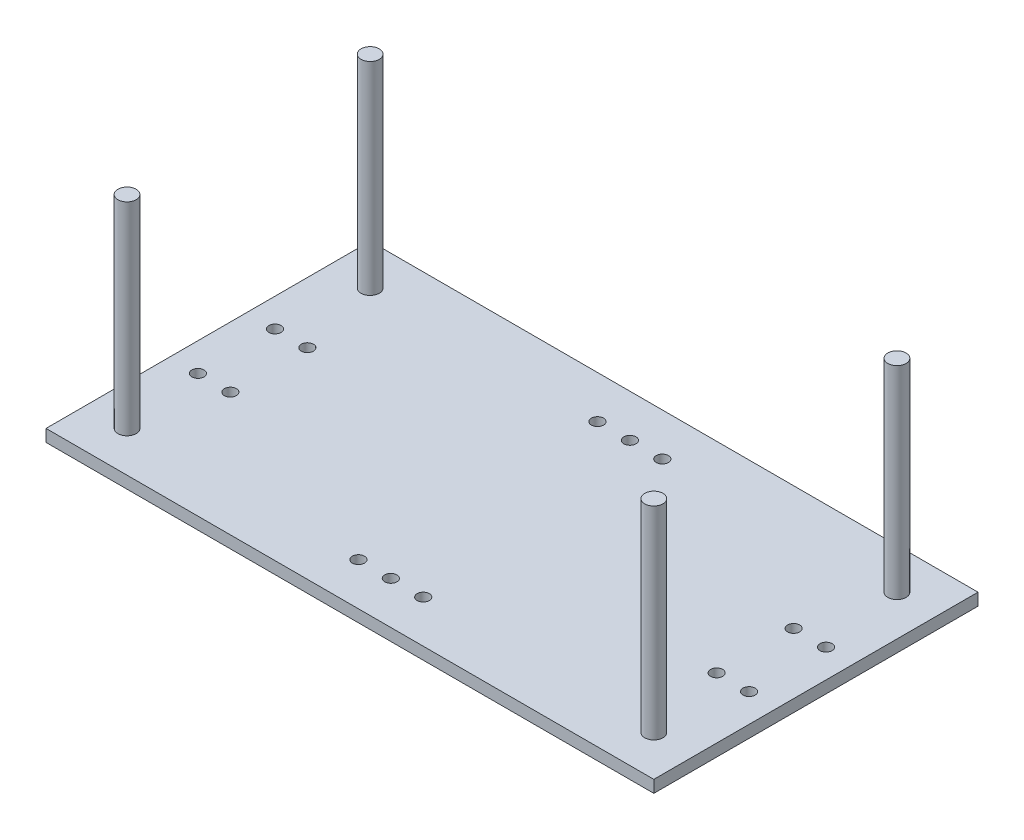
ISO-10303-21;
HEADER;
FILE_DESCRIPTION(('STEP AP214'),'2;1');
FILE_NAME('part.step','',(''),(''),'','','');
FILE_SCHEMA(('AUTOMOTIVE_DESIGN { 1 0 10303 214 1 1 1 1 }'));
ENDSEC;
DATA;
#1=APPLICATION_CONTEXT('core data for automotive mechanical design processes');
#2=APPLICATION_PROTOCOL_DEFINITION('international standard','automotive_design',2000,#1);
#3=PRODUCT_CONTEXT('',#1,'mechanical');
#4=PRODUCT('Part','Part','',(#3));
#5=PRODUCT_RELATED_PRODUCT_CATEGORY('part','',(#4));
#6=PRODUCT_DEFINITION_FORMATION('','',#4);
#7=PRODUCT_DEFINITION_CONTEXT('part definition',#1,'design');
#8=PRODUCT_DEFINITION('design','',#6,#7);
#9=PRODUCT_DEFINITION_SHAPE('','',#8);
#10=(LENGTH_UNIT() NAMED_UNIT(*) SI_UNIT(.MILLI.,.METRE.));
#11=(NAMED_UNIT(*) PLANE_ANGLE_UNIT() SI_UNIT($,.RADIAN.));
#12=(NAMED_UNIT(*) SI_UNIT($,.STERADIAN.) SOLID_ANGLE_UNIT());
#13=UNCERTAINTY_MEASURE_WITH_UNIT(LENGTH_MEASURE(1.E-05),#10,'distance_accuracy_value','');
#14=(GEOMETRIC_REPRESENTATION_CONTEXT(3) GLOBAL_UNCERTAINTY_ASSIGNED_CONTEXT((#13)) GLOBAL_UNIT_ASSIGNED_CONTEXT((#10,
#11,#12)) REPRESENTATION_CONTEXT('',''));
#15=CARTESIAN_POINT('',(0.,0.,0.));
#16=DIRECTION('',(0.,0.,1.));
#17=DIRECTION('',(1.,0.,0.));
#18=AXIS2_PLACEMENT_3D('',#15,#16,#17);
#19=CARTESIAN_POINT('',(66.5352697095436,-3.,0.));
#20=DIRECTION('',(-1.,0.,0.));
#21=DIRECTION('',(0.,0.,1.));
#22=AXIS2_PLACEMENT_3D('',#19,#20,#21);
#23=PLANE('',#22);
#24=DIRECTION('',(0.,0.,1.));
#25=VECTOR('',#24,1.);
#26=CARTESIAN_POINT('',(66.5352697095436,0.,0.));
#27=LINE('',#26,#25);
#28=CARTESIAN_POINT('',(66.5352697095435,0.,-41.8257261410789));
#29=VERTEX_POINT('',#28);
#30=CARTESIAN_POINT('',(66.5352697095436,0.,38.1742738589212));
#31=VERTEX_POINT('',#30);
#32=EDGE_CURVE('E134',#29,#31,#27,.T.);
#33=ORIENTED_EDGE('',*,*,#32,.T.);
#34=DIRECTION('',(0.,1.,0.));
#35=VECTOR('',#34,1.);
#36=CARTESIAN_POINT('',(66.5352697095436,-3.,38.1742738589212));
#37=LINE('',#36,#35);
#38=CARTESIAN_POINT('',(66.5352697095436,-3.,38.1742738589212));
#39=VERTEX_POINT('',#38);
#40=EDGE_CURVE('E11',#39,#31,#37,.T.);
#41=ORIENTED_EDGE('',*,*,#40,.F.);
#42=DIRECTION('',(0.,0.,1.));
#43=VECTOR('',#42,1.);
#44=CARTESIAN_POINT('',(66.5352697095436,-3.,0.));
#45=LINE('',#44,#43);
#46=CARTESIAN_POINT('',(66.5352697095435,-3.,-41.8257261410789));
#47=VERTEX_POINT('',#46);
#48=EDGE_CURVE('E62',#47,#39,#45,.T.);
#49=ORIENTED_EDGE('',*,*,#48,.F.);
#50=DIRECTION('',(0.,1.,0.));
#51=VECTOR('',#50,1.);
#52=CARTESIAN_POINT('',(66.5352697095435,-3.,-41.8257261410789));
#53=LINE('',#52,#51);
#54=EDGE_CURVE('E97',#47,#29,#53,.T.);
#55=ORIENTED_EDGE('',*,*,#54,.T.);
#56=EDGE_LOOP('',(#33,#41,#49,#55));
#57=FACE_BOUND('',#56,.T.);
#58=ADVANCED_FACE('F43',(#57),#23,.F.);
#59=CARTESIAN_POINT('',(0.,-3.,38.1742738589212));
#60=DIRECTION('',(0.,0.,1.));
#61=DIRECTION('',(1.,0.,0.));
#62=AXIS2_PLACEMENT_3D('',#59,#60,#61);
#63=PLANE('',#62);
#64=DIRECTION('',(1.,0.,0.));
#65=VECTOR('',#64,1.);
#66=CARTESIAN_POINT('',(0.,0.,38.1742738589212));
#67=LINE('',#66,#65);
#68=CARTESIAN_POINT('',(-83.4647302904564,0.,38.1742738589212));
#69=VERTEX_POINT('',#68);
#70=EDGE_CURVE('E139',#69,#31,#67,.T.);
#71=ORIENTED_EDGE('',*,*,#70,.F.);
#72=DIRECTION('',(0.,1.,0.));
#73=VECTOR('',#72,1.);
#74=CARTESIAN_POINT('',(-83.4647302904564,-3.,38.1742738589212));
#75=LINE('',#74,#73);
#76=CARTESIAN_POINT('',(-83.4647302904564,-3.,38.1742738589212));
#77=VERTEX_POINT('',#76);
#78=EDGE_CURVE('E53',#77,#69,#75,.T.);
#79=ORIENTED_EDGE('',*,*,#78,.F.);
#80=DIRECTION('',(1.,0.,0.));
#81=VECTOR('',#80,1.);
#82=CARTESIAN_POINT('',(0.,-3.,38.1742738589212));
#83=LINE('',#82,#81);
#84=EDGE_CURVE('E104',#77,#39,#83,.T.);
#85=ORIENTED_EDGE('',*,*,#84,.T.);
#86=ORIENTED_EDGE('',*,*,#40,.T.);
#87=EDGE_LOOP('',(#71,#79,#85,#86));
#88=FACE_BOUND('',#87,.T.);
#89=ADVANCED_FACE('F255',(#88),#63,.T.);
#90=CARTESIAN_POINT('',(-83.4647302904564,-3.,0.));
#91=DIRECTION('',(-1.,0.,0.));
#92=DIRECTION('',(0.,0.,1.));
#93=AXIS2_PLACEMENT_3D('',#90,#91,#92);
#94=PLANE('',#93);
#95=DIRECTION('',(0.,0.,1.));
#96=VECTOR('',#95,1.);
#97=CARTESIAN_POINT('',(-83.4647302904564,0.,0.));
#98=LINE('',#97,#96);
#99=CARTESIAN_POINT('',(-83.4647302904565,0.,-41.8257261410789));
#100=VERTEX_POINT('',#99);
#101=EDGE_CURVE('E94',#100,#69,#98,.T.);
#102=ORIENTED_EDGE('',*,*,#101,.F.);
#103=DIRECTION('',(0.,1.,0.));
#104=VECTOR('',#103,1.);
#105=CARTESIAN_POINT('',(-83.4647302904565,-3.,-41.8257261410789));
#106=LINE('',#105,#104);
#107=CARTESIAN_POINT('',(-83.4647302904565,-3.,-41.8257261410789));
#108=VERTEX_POINT('',#107);
#109=EDGE_CURVE('E91',#108,#100,#106,.T.);
#110=ORIENTED_EDGE('',*,*,#109,.F.);
#111=DIRECTION('',(0.,0.,1.));
#112=VECTOR('',#111,1.);
#113=CARTESIAN_POINT('',(-83.4647302904564,-3.,0.));
#114=LINE('',#113,#112);
#115=EDGE_CURVE('E93',#108,#77,#114,.T.);
#116=ORIENTED_EDGE('',*,*,#115,.T.);
#117=ORIENTED_EDGE('',*,*,#78,.T.);
#118=EDGE_LOOP('',(#102,#110,#116,#117));
#119=FACE_BOUND('',#118,.T.);
#120=ADVANCED_FACE('F92',(#119),#94,.T.);
#121=CARTESIAN_POINT('',(-68.4647302904565,-3.,-11.3257261410788));
#122=DIRECTION('',(0.,1.,0.));
#123=DIRECTION('',(0.,0.,1.));
#124=AXIS2_PLACEMENT_3D('',#121,#122,#123);
#125=CYLINDRICAL_SURFACE('',#124,1.5);
#126=CARTESIAN_POINT('',(-68.4647302904565,-3.,-11.3257261410788));
#127=DIRECTION('',(0.,1.,0.));
#128=DIRECTION('',(0.,0.,1.));
#129=AXIS2_PLACEMENT_3D('',#126,#127,#128);
#130=CIRCLE('',#129,1.5);
#131=CARTESIAN_POINT('',(-68.4647302904565,-3.,-9.82572614107885));
#132=VERTEX_POINT('',#131);
#133=EDGE_CURVE('E118',#132,#132,#130,.T.);
#134=ORIENTED_EDGE('',*,*,#133,.F.);
#135=EDGE_LOOP('',(#134));
#136=FACE_BOUND('',#135,.T.);
#137=CARTESIAN_POINT('',(-68.4647302904565,0.,-11.3257261410788));
#138=DIRECTION('',(0.,1.,0.));
#139=DIRECTION('',(0.,0.,1.));
#140=AXIS2_PLACEMENT_3D('',#137,#138,#139);
#141=CIRCLE('',#140,1.5);
#142=CARTESIAN_POINT('',(-68.4647302904565,0.,-9.82572614107885));
#143=VERTEX_POINT('',#142);
#144=EDGE_CURVE('E151',#143,#143,#141,.T.);
#145=ORIENTED_EDGE('',*,*,#144,.T.);
#146=EDGE_LOOP('',(#145));
#147=FACE_BOUND('',#146,.T.);
#148=ADVANCED_FACE('F538',(#136,#147),#125,.F.);
#149=CARTESIAN_POINT('',(-76.4647302904565,-3.,-11.3257261410788));
#150=DIRECTION('',(0.,1.,0.));
#151=DIRECTION('',(0.,0.,1.));
#152=AXIS2_PLACEMENT_3D('',#149,#150,#151);
#153=CYLINDRICAL_SURFACE('',#152,1.5);
#154=CARTESIAN_POINT('',(-76.4647302904565,-3.,-11.3257261410788));
#155=DIRECTION('',(0.,1.,0.));
#156=DIRECTION('',(0.,0.,1.));
#157=AXIS2_PLACEMENT_3D('',#154,#155,#156);
#158=CIRCLE('',#157,1.5);
#159=CARTESIAN_POINT('',(-76.4647302904565,-3.,-9.82572614107885));
#160=VERTEX_POINT('',#159);
#161=EDGE_CURVE('E115',#160,#160,#158,.T.);
#162=ORIENTED_EDGE('',*,*,#161,.F.);
#163=EDGE_LOOP('',(#162));
#164=FACE_BOUND('',#163,.T.);
#165=CARTESIAN_POINT('',(-76.4647302904565,0.,-11.3257261410788));
#166=DIRECTION('',(0.,1.,0.));
#167=DIRECTION('',(0.,0.,1.));
#168=AXIS2_PLACEMENT_3D('',#165,#166,#167);
#169=CIRCLE('',#168,1.5);
#170=CARTESIAN_POINT('',(-76.4647302904565,0.,-9.82572614107885));
#171=VERTEX_POINT('',#170);
#172=EDGE_CURVE('E148',#171,#171,#169,.T.);
#173=ORIENTED_EDGE('',*,*,#172,.T.);
#174=EDGE_LOOP('',(#173));
#175=FACE_BOUND('',#174,.T.);
#176=ADVANCED_FACE('F529',(#164,#175),#153,.F.);
#177=CARTESIAN_POINT('',(59.5352697095435,-3.,-11.3257261410789));
#178=DIRECTION('',(0.,1.,0.));
#179=DIRECTION('',(0.,0.,1.));
#180=AXIS2_PLACEMENT_3D('',#177,#178,#179);
#181=CYLINDRICAL_SURFACE('',#180,1.5);
#182=CARTESIAN_POINT('',(59.5352697095435,-3.,-11.3257261410789));
#183=DIRECTION('',(0.,1.,0.));
#184=DIRECTION('',(0.,0.,1.));
#185=AXIS2_PLACEMENT_3D('',#182,#183,#184);
#186=CIRCLE('',#185,1.5);
#187=CARTESIAN_POINT('',(59.5352697095435,-3.,-9.82572614107888));
#188=VERTEX_POINT('',#187);
#189=EDGE_CURVE('E112',#188,#188,#186,.F.);
#190=ORIENTED_EDGE('',*,*,#189,.T.);
#191=EDGE_LOOP('',(#190));
#192=FACE_BOUND('',#191,.T.);
#193=CARTESIAN_POINT('',(59.5352697095435,0.,-11.3257261410789));
#194=DIRECTION('',(0.,1.,0.));
#195=DIRECTION('',(0.,0.,1.));
#196=AXIS2_PLACEMENT_3D('',#193,#194,#195);
#197=CIRCLE('',#196,1.5);
#198=CARTESIAN_POINT('',(59.5352697095435,0.,-9.82572614107888));
#199=VERTEX_POINT('',#198);
#200=EDGE_CURVE('E145',#199,#199,#197,.F.);
#201=ORIENTED_EDGE('',*,*,#200,.F.);
#202=EDGE_LOOP('',(#201));
#203=FACE_BOUND('',#202,.T.);
#204=ADVANCED_FACE('F520',(#192,#203),#181,.F.);
#205=CARTESIAN_POINT('',(59.5352697095436,-3.,7.67427385892113));
#206=DIRECTION('',(0.,1.,0.));
#207=DIRECTION('',(0.,0.,1.));
#208=AXIS2_PLACEMENT_3D('',#205,#206,#207);
#209=CYLINDRICAL_SURFACE('',#208,1.5);
#210=CARTESIAN_POINT('',(59.5352697095436,-3.,7.67427385892113));
#211=DIRECTION('',(0.,1.,0.));
#212=DIRECTION('',(0.,0.,1.));
#213=AXIS2_PLACEMENT_3D('',#210,#211,#212);
#214=CIRCLE('',#213,1.5);
#215=CARTESIAN_POINT('',(59.5352697095436,-3.,9.17427385892113));
#216=VERTEX_POINT('',#215);
#217=EDGE_CURVE('E106',#216,#216,#214,.F.);
#218=ORIENTED_EDGE('',*,*,#217,.T.);
#219=EDGE_LOOP('',(#218));
#220=FACE_BOUND('',#219,.T.);
#221=CARTESIAN_POINT('',(59.5352697095436,0.,7.67427385892113));
#222=DIRECTION('',(0.,1.,0.));
#223=DIRECTION('',(0.,0.,1.));
#224=AXIS2_PLACEMENT_3D('',#221,#222,#223);
#225=CIRCLE('',#224,1.5);
#226=CARTESIAN_POINT('',(59.5352697095436,0.,9.17427385892113));
#227=VERTEX_POINT('',#226);
#228=EDGE_CURVE('E142',#227,#227,#225,.F.);
#229=ORIENTED_EDGE('',*,*,#228,.F.);
#230=EDGE_LOOP('',(#229));
#231=FACE_BOUND('',#230,.T.);
#232=ADVANCED_FACE('F513',(#220,#231),#209,.F.);
#233=CARTESIAN_POINT('',(0.,-3.,-41.8257261410789));
#234=DIRECTION('',(0.,0.,1.));
#235=DIRECTION('',(1.,0.,0.));
#236=AXIS2_PLACEMENT_3D('',#233,#234,#235);
#237=PLANE('',#236);
#238=DIRECTION('',(1.,0.,0.));
#239=VECTOR('',#238,1.);
#240=CARTESIAN_POINT('',(0.,0.,-41.8257261410789));
#241=LINE('',#240,#239);
#242=EDGE_CURVE('E136',#100,#29,#241,.T.);
#243=ORIENTED_EDGE('',*,*,#242,.T.);
#244=ORIENTED_EDGE('',*,*,#54,.F.);
#245=DIRECTION('',(1.,0.,0.));
#246=VECTOR('',#245,1.);
#247=CARTESIAN_POINT('',(0.,-3.,-41.8257261410789));
#248=LINE('',#247,#246);
#249=EDGE_CURVE('E88',#108,#47,#248,.T.);
#250=ORIENTED_EDGE('',*,*,#249,.F.);
#251=ORIENTED_EDGE('',*,*,#109,.T.);
#252=EDGE_LOOP('',(#243,#244,#250,#251));
#253=FACE_BOUND('',#252,.T.);
#254=ADVANCED_FACE('F99',(#253),#237,.F.);
#255=CARTESIAN_POINT('',(-68.4647302904565,-3.,7.67427385892115));
#256=DIRECTION('',(0.,1.,0.));
#257=DIRECTION('',(0.,0.,1.));
#258=AXIS2_PLACEMENT_3D('',#255,#256,#257);
#259=CYLINDRICAL_SURFACE('',#258,1.5);
#260=CARTESIAN_POINT('',(-68.4647302904565,-3.,7.67427385892115));
#261=DIRECTION('',(0.,1.,0.));
#262=DIRECTION('',(0.,0.,1.));
#263=AXIS2_PLACEMENT_3D('',#260,#261,#262);
#264=CIRCLE('',#263,1.5);
#265=CARTESIAN_POINT('',(-68.4647302904565,-3.,9.17427385892115));
#266=VERTEX_POINT('',#265);
#267=EDGE_CURVE('E211',#266,#266,#264,.T.);
#268=ORIENTED_EDGE('',*,*,#267,.F.);
#269=EDGE_LOOP('',(#268));
#270=FACE_BOUND('',#269,.T.);
#271=CARTESIAN_POINT('',(-68.4647302904565,0.,7.67427385892115));
#272=DIRECTION('',(0.,1.,0.));
#273=DIRECTION('',(0.,0.,1.));
#274=AXIS2_PLACEMENT_3D('',#271,#272,#273);
#275=CIRCLE('',#274,1.5);
#276=CARTESIAN_POINT('',(-68.4647302904565,0.,9.17427385892115));
#277=VERTEX_POINT('',#276);
#278=EDGE_CURVE('E131',#277,#277,#275,.T.);
#279=ORIENTED_EDGE('',*,*,#278,.T.);
#280=EDGE_LOOP('',(#279));
#281=FACE_BOUND('',#280,.T.);
#282=ADVANCED_FACE('F216',(#270,#281),#259,.F.);
#283=CARTESIAN_POINT('',(-76.4647302904564,-3.,7.67427385892115));
#284=DIRECTION('',(0.,1.,0.));
#285=DIRECTION('',(0.,0.,1.));
#286=AXIS2_PLACEMENT_3D('',#283,#284,#285);
#287=CYLINDRICAL_SURFACE('',#286,1.5);
#288=CARTESIAN_POINT('',(-76.4647302904564,-3.,7.67427385892115));
#289=DIRECTION('',(0.,1.,0.));
#290=DIRECTION('',(0.,0.,1.));
#291=AXIS2_PLACEMENT_3D('',#288,#289,#290);
#292=CIRCLE('',#291,1.5);
#293=CARTESIAN_POINT('',(-76.4647302904564,-3.,9.17427385892115));
#294=VERTEX_POINT('',#293);
#295=EDGE_CURVE('E208',#294,#294,#292,.T.);
#296=ORIENTED_EDGE('',*,*,#295,.F.);
#297=EDGE_LOOP('',(#296));
#298=FACE_BOUND('',#297,.T.);
#299=CARTESIAN_POINT('',(-76.4647302904564,0.,7.67427385892115));
#300=DIRECTION('',(0.,1.,0.));
#301=DIRECTION('',(0.,0.,1.));
#302=AXIS2_PLACEMENT_3D('',#299,#300,#301);
#303=CIRCLE('',#302,1.5);
#304=CARTESIAN_POINT('',(-76.4647302904564,0.,9.17427385892115));
#305=VERTEX_POINT('',#304);
#306=EDGE_CURVE('E127',#305,#305,#303,.T.);
#307=ORIENTED_EDGE('',*,*,#306,.T.);
#308=EDGE_LOOP('',(#307));
#309=FACE_BOUND('',#308,.T.);
#310=ADVANCED_FACE('F219',(#298,#309),#287,.F.);
#311=CARTESIAN_POINT('',(51.5352697095436,-3.,7.67427385892113));
#312=DIRECTION('',(0.,1.,0.));
#313=DIRECTION('',(0.,0.,1.));
#314=AXIS2_PLACEMENT_3D('',#311,#312,#313);
#315=CYLINDRICAL_SURFACE('',#314,1.5);
#316=CARTESIAN_POINT('',(51.5352697095436,-3.,7.67427385892113));
#317=DIRECTION('',(0.,1.,0.));
#318=DIRECTION('',(0.,0.,1.));
#319=AXIS2_PLACEMENT_3D('',#316,#317,#318);
#320=CIRCLE('',#319,1.5);
#321=CARTESIAN_POINT('',(51.5352697095436,-3.,9.17427385892113));
#322=VERTEX_POINT('',#321);
#323=EDGE_CURVE('E156',#322,#322,#320,.F.);
#324=ORIENTED_EDGE('',*,*,#323,.T.);
#325=EDGE_LOOP('',(#324));
#326=FACE_BOUND('',#325,.T.);
#327=CARTESIAN_POINT('',(51.5352697095436,0.,7.67427385892113));
#328=DIRECTION('',(0.,1.,0.));
#329=DIRECTION('',(0.,0.,1.));
#330=AXIS2_PLACEMENT_3D('',#327,#328,#329);
#331=CIRCLE('',#330,1.5);
#332=CARTESIAN_POINT('',(51.5352697095436,0.,9.17427385892113));
#333=VERTEX_POINT('',#332);
#334=EDGE_CURVE('E124',#333,#333,#331,.F.);
#335=ORIENTED_EDGE('',*,*,#334,.F.);
#336=EDGE_LOOP('',(#335));
#337=FACE_BOUND('',#336,.T.);
#338=ADVANCED_FACE('F45',(#326,#337),#315,.F.);
#339=CARTESIAN_POINT('',(51.5352697095436,-3.,-11.3257261410789));
#340=DIRECTION('',(0.,1.,0.));
#341=DIRECTION('',(0.,0.,1.));
#342=AXIS2_PLACEMENT_3D('',#339,#340,#341);
#343=CYLINDRICAL_SURFACE('',#342,1.49999999999999);
#344=CARTESIAN_POINT('',(51.5352697095436,-3.,-11.3257261410789));
#345=DIRECTION('',(0.,1.,0.));
#346=DIRECTION('',(0.,0.,1.));
#347=AXIS2_PLACEMENT_3D('',#344,#345,#346);
#348=CIRCLE('',#347,1.49999999999999);
#349=CARTESIAN_POINT('',(51.5352697095436,-3.,-9.82572614107888));
#350=VERTEX_POINT('',#349);
#351=EDGE_CURVE('E121',#350,#350,#348,.F.);
#352=ORIENTED_EDGE('',*,*,#351,.T.);
#353=EDGE_LOOP('',(#352));
#354=FACE_BOUND('',#353,.T.);
#355=CARTESIAN_POINT('',(51.5352697095436,0.,-11.3257261410789));
#356=DIRECTION('',(0.,1.,0.));
#357=DIRECTION('',(0.,0.,1.));
#358=AXIS2_PLACEMENT_3D('',#355,#356,#357);
#359=CIRCLE('',#358,1.49999999999999);
#360=CARTESIAN_POINT('',(51.5352697095436,0.,-9.82572614107888));
#361=VERTEX_POINT('',#360);
#362=EDGE_CURVE('E154',#361,#361,#359,.F.);
#363=ORIENTED_EDGE('',*,*,#362,.F.);
#364=EDGE_LOOP('',(#363));
#365=FACE_BOUND('',#364,.T.);
#366=ADVANCED_FACE('F241',(#354,#365),#343,.F.);
#367=CARTESIAN_POINT('',(0.,-3.,0.));
#368=DIRECTION('',(0.,1.,0.));
#369=DIRECTION('',(0.,0.,1.));
#370=AXIS2_PLACEMENT_3D('',#367,#368,#369);
#371=PLANE('',#370);
#372=CARTESIAN_POINT('',(-8.86738200398361,-3.,-31.3257261410796));
#373=DIRECTION('',(0.,-1.,0.));
#374=DIRECTION('',(0.,0.,-1.));
#375=AXIS2_PLACEMENT_3D('',#372,#373,#374);
#376=CIRCLE('',#375,1.5);
#377=CARTESIAN_POINT('',(-8.86738200398361,-3.,-32.8257261410796));
#378=VERTEX_POINT('',#377);
#379=EDGE_CURVE('E436',#378,#378,#376,.T.);
#380=ORIENTED_EDGE('',*,*,#379,.F.);
#381=EDGE_LOOP('',(#380));
#382=FACE_BOUND('',#381,.T.);
#383=CARTESIAN_POINT('',(-0.867382003983605,-3.,-31.3257261410796));
#384=DIRECTION('',(0.,-1.,0.));
#385=DIRECTION('',(0.,0.,-1.));
#386=AXIS2_PLACEMENT_3D('',#383,#384,#385);
#387=CIRCLE('',#386,1.5);
#388=CARTESIAN_POINT('',(-0.867382003983605,-3.,-32.8257261410796));
#389=VERTEX_POINT('',#388);
#390=EDGE_CURVE('E437',#389,#389,#387,.T.);
#391=ORIENTED_EDGE('',*,*,#390,.F.);
#392=EDGE_LOOP('',(#391));
#393=FACE_BOUND('',#392,.T.);
#394=CARTESIAN_POINT('',(-16.8673820039836,-3.,27.6742738589218));
#395=DIRECTION('',(0.,-1.,0.));
#396=DIRECTION('',(0.,0.,-1.));
#397=AXIS2_PLACEMENT_3D('',#394,#395,#396);
#398=CIRCLE('',#397,1.5);
#399=CARTESIAN_POINT('',(-16.8673820039836,-3.,26.1742738589218));
#400=VERTEX_POINT('',#399);
#401=EDGE_CURVE('E441',#400,#400,#398,.T.);
#402=ORIENTED_EDGE('',*,*,#401,.F.);
#403=EDGE_LOOP('',(#402));
#404=FACE_BOUND('',#403,.T.);
#405=CARTESIAN_POINT('',(-8.86738200398359,-3.,27.6742738589218));
#406=DIRECTION('',(0.,-1.,0.));
#407=DIRECTION('',(0.,0.,-1.));
#408=AXIS2_PLACEMENT_3D('',#405,#406,#407);
#409=CIRCLE('',#408,1.5);
#410=CARTESIAN_POINT('',(-8.86738200398359,-3.,26.1742738589218));
#411=VERTEX_POINT('',#410);
#412=EDGE_CURVE('E448',#411,#411,#409,.T.);
#413=ORIENTED_EDGE('',*,*,#412,.F.);
#414=EDGE_LOOP('',(#413));
#415=FACE_BOUND('',#414,.T.);
#416=CARTESIAN_POINT('',(-0.867382003983591,-3.,27.6742738589218));
#417=DIRECTION('',(0.,-1.,0.));
#418=DIRECTION('',(0.,0.,-1.));
#419=AXIS2_PLACEMENT_3D('',#416,#417,#418);
#420=CIRCLE('',#419,1.5);
#421=CARTESIAN_POINT('',(-0.867382003983591,-3.,26.1742738589218));
#422=VERTEX_POINT('',#421);
#423=EDGE_CURVE('E444',#422,#422,#420,.T.);
#424=ORIENTED_EDGE('',*,*,#423,.F.);
#425=EDGE_LOOP('',(#424));
#426=FACE_BOUND('',#425,.T.);
#427=CARTESIAN_POINT('',(-16.8673820039836,-3.,-31.3257261410796));
#428=DIRECTION('',(0.,-1.,0.));
#429=DIRECTION('',(0.,0.,-1.));
#430=AXIS2_PLACEMENT_3D('',#427,#428,#429);
#431=CIRCLE('',#430,1.5);
#432=CARTESIAN_POINT('',(-16.8673820039836,-3.,-32.8257261410796));
#433=VERTEX_POINT('',#432);
#434=EDGE_CURVE('E164',#433,#433,#431,.T.);
#435=ORIENTED_EDGE('',*,*,#434,.F.);
#436=EDGE_LOOP('',(#435));
#437=FACE_BOUND('',#436,.T.);
#438=ORIENTED_EDGE('',*,*,#323,.F.);
#439=EDGE_LOOP('',(#438));
#440=FACE_BOUND('',#439,.T.);
#441=ORIENTED_EDGE('',*,*,#295,.T.);
#442=EDGE_LOOP('',(#441));
#443=FACE_BOUND('',#442,.T.);
#444=ORIENTED_EDGE('',*,*,#267,.T.);
#445=EDGE_LOOP('',(#444));
#446=FACE_BOUND('',#445,.T.);
#447=ORIENTED_EDGE('',*,*,#48,.T.);
#448=ORIENTED_EDGE('',*,*,#84,.F.);
#449=ORIENTED_EDGE('',*,*,#115,.F.);
#450=ORIENTED_EDGE('',*,*,#249,.T.);
#451=EDGE_LOOP('',(#447,#448,#449,#450));
#452=FACE_BOUND('',#451,.T.);
#453=ORIENTED_EDGE('',*,*,#217,.F.);
#454=EDGE_LOOP('',(#453));
#455=FACE_BOUND('',#454,.T.);
#456=ORIENTED_EDGE('',*,*,#189,.F.);
#457=EDGE_LOOP('',(#456));
#458=FACE_BOUND('',#457,.T.);
#459=ORIENTED_EDGE('',*,*,#161,.T.);
#460=EDGE_LOOP('',(#459));
#461=FACE_BOUND('',#460,.T.);
#462=ORIENTED_EDGE('',*,*,#133,.T.);
#463=EDGE_LOOP('',(#462));
#464=FACE_BOUND('',#463,.T.);
#465=ORIENTED_EDGE('',*,*,#351,.F.);
#466=EDGE_LOOP('',(#465));
#467=FACE_BOUND('',#466,.T.);
#468=ADVANCED_FACE('F102',(#382,#393,#404,#415,#426,#437,#440,#443,#446,#452,#455,#458,#461,
#464,#467),#371,.F.);
#469=CARTESIAN_POINT('',(0.,0.,0.));
#470=DIRECTION('',(0.,1.,0.));
#471=DIRECTION('',(0.,0.,1.));
#472=AXIS2_PLACEMENT_3D('',#469,#470,#471);
#473=PLANE('',#472);
#474=CARTESIAN_POINT('',(-8.86738200398361,0.,-31.3257261410796));
#475=DIRECTION('',(0.,1.,0.));
#476=DIRECTION('',(0.,0.,1.));
#477=AXIS2_PLACEMENT_3D('',#474,#475,#476);
#478=CIRCLE('',#477,1.5);
#479=CARTESIAN_POINT('',(-8.86738200398361,0.,-29.8257261410796));
#480=VERTEX_POINT('',#479);
#481=EDGE_CURVE('E47',#480,#480,#478,.T.);
#482=ORIENTED_EDGE('',*,*,#481,.F.);
#483=EDGE_LOOP('',(#482));
#484=FACE_BOUND('',#483,.T.);
#485=CARTESIAN_POINT('',(-0.867382003983605,0.,-31.3257261410796));
#486=DIRECTION('',(0.,1.,0.));
#487=DIRECTION('',(0.,0.,1.));
#488=AXIS2_PLACEMENT_3D('',#485,#486,#487);
#489=CIRCLE('',#488,1.5);
#490=CARTESIAN_POINT('',(-0.867382003983605,0.,-29.8257261410796));
#491=VERTEX_POINT('',#490);
#492=EDGE_CURVE('E172',#491,#491,#489,.T.);
#493=ORIENTED_EDGE('',*,*,#492,.F.);
#494=EDGE_LOOP('',(#493));
#495=FACE_BOUND('',#494,.T.);
#496=CARTESIAN_POINT('',(-16.8673820039836,0.,27.6742738589218));
#497=DIRECTION('',(0.,1.,0.));
#498=DIRECTION('',(0.,0.,1.));
#499=AXIS2_PLACEMENT_3D('',#496,#497,#498);
#500=CIRCLE('',#499,1.5);
#501=CARTESIAN_POINT('',(-16.8673820039836,0.,29.1742738589218));
#502=VERTEX_POINT('',#501);
#503=EDGE_CURVE('E170',#502,#502,#500,.T.);
#504=ORIENTED_EDGE('',*,*,#503,.F.);
#505=EDGE_LOOP('',(#504));
#506=FACE_BOUND('',#505,.T.);
#507=CARTESIAN_POINT('',(-8.86738200398359,0.,27.6742738589218));
#508=DIRECTION('',(0.,1.,0.));
#509=DIRECTION('',(0.,0.,1.));
#510=AXIS2_PLACEMENT_3D('',#507,#508,#509);
#511=CIRCLE('',#510,1.5);
#512=CARTESIAN_POINT('',(-8.86738200398359,0.,29.1742738589218));
#513=VERTEX_POINT('',#512);
#514=EDGE_CURVE('E167',#513,#513,#511,.T.);
#515=ORIENTED_EDGE('',*,*,#514,.F.);
#516=EDGE_LOOP('',(#515));
#517=FACE_BOUND('',#516,.T.);
#518=CARTESIAN_POINT('',(-0.867382003983591,0.,27.6742738589218));
#519=DIRECTION('',(0.,1.,0.));
#520=DIRECTION('',(0.,0.,1.));
#521=AXIS2_PLACEMENT_3D('',#518,#519,#520);
#522=CIRCLE('',#521,1.5);
#523=CARTESIAN_POINT('',(-0.867382003983591,0.,29.1742738589218));
#524=VERTEX_POINT('',#523);
#525=EDGE_CURVE('E163',#524,#524,#522,.T.);
#526=ORIENTED_EDGE('',*,*,#525,.F.);
#527=EDGE_LOOP('',(#526));
#528=FACE_BOUND('',#527,.T.);
#529=CARTESIAN_POINT('',(-16.8673820039836,0.,-31.3257261410796));
#530=DIRECTION('',(0.,1.,0.));
#531=DIRECTION('',(0.,0.,1.));
#532=AXIS2_PLACEMENT_3D('',#529,#530,#531);
#533=CIRCLE('',#532,1.5);
#534=CARTESIAN_POINT('',(-16.8673820039836,0.,-29.8257261410796));
#535=VERTEX_POINT('',#534);
#536=EDGE_CURVE('E160',#535,#535,#533,.T.);
#537=ORIENTED_EDGE('',*,*,#536,.F.);
#538=EDGE_LOOP('',(#537));
#539=FACE_BOUND('',#538,.T.);
#540=CARTESIAN_POINT('',(-73.4647302904565,0.,-31.8257261410788));
#541=DIRECTION('',(0.,1.,0.));
#542=DIRECTION('',(0.,0.,1.));
#543=AXIS2_PLACEMENT_3D('',#540,#541,#542);
#544=CIRCLE('',#543,2.25);
#545=CARTESIAN_POINT('',(-73.4647302904565,0.,-29.5757261410789));
#546=VERTEX_POINT('',#545);
#547=EDGE_CURVE('E177',#546,#546,#544,.T.);
#548=ORIENTED_EDGE('',*,*,#547,.F.);
#549=EDGE_LOOP('',(#548));
#550=FACE_BOUND('',#549,.T.);
#551=CARTESIAN_POINT('',(-73.4647302904565,0.,28.1742738589212));
#552=DIRECTION('',(0.,1.,0.));
#553=DIRECTION('',(0.,0.,1.));
#554=AXIS2_PLACEMENT_3D('',#551,#552,#553);
#555=CIRCLE('',#554,2.25);
#556=CARTESIAN_POINT('',(-73.4647302904565,0.,30.4242738589212));
#557=VERTEX_POINT('',#556);
#558=EDGE_CURVE('E186',#557,#557,#555,.T.);
#559=ORIENTED_EDGE('',*,*,#558,.F.);
#560=EDGE_LOOP('',(#559));
#561=FACE_BOUND('',#560,.T.);
#562=CARTESIAN_POINT('',(56.5352697095435,0.,28.1742738589212));
#563=DIRECTION('',(0.,1.,0.));
#564=DIRECTION('',(0.,0.,1.));
#565=AXIS2_PLACEMENT_3D('',#562,#563,#564);
#566=CIRCLE('',#565,2.25);
#567=CARTESIAN_POINT('',(56.5352697095435,0.,30.4242738589212));
#568=VERTEX_POINT('',#567);
#569=EDGE_CURVE('E193',#568,#568,#566,.T.);
#570=ORIENTED_EDGE('',*,*,#569,.F.);
#571=EDGE_LOOP('',(#570));
#572=FACE_BOUND('',#571,.T.);
#573=CARTESIAN_POINT('',(56.5352697095435,0.,-31.8257261410788));
#574=DIRECTION('',(0.,1.,0.));
#575=DIRECTION('',(0.,0.,1.));
#576=AXIS2_PLACEMENT_3D('',#573,#574,#575);
#577=CIRCLE('',#576,2.25);
#578=CARTESIAN_POINT('',(56.5352697095435,0.,-29.5757261410788));
#579=VERTEX_POINT('',#578);
#580=EDGE_CURVE('E199',#579,#579,#577,.T.);
#581=ORIENTED_EDGE('',*,*,#580,.F.);
#582=EDGE_LOOP('',(#581));
#583=FACE_BOUND('',#582,.T.);
#584=ORIENTED_EDGE('',*,*,#334,.T.);
#585=EDGE_LOOP('',(#584));
#586=FACE_BOUND('',#585,.T.);
#587=ORIENTED_EDGE('',*,*,#306,.F.);
#588=EDGE_LOOP('',(#587));
#589=FACE_BOUND('',#588,.T.);
#590=ORIENTED_EDGE('',*,*,#278,.F.);
#591=EDGE_LOOP('',(#590));
#592=FACE_BOUND('',#591,.T.);
#593=ORIENTED_EDGE('',*,*,#32,.F.);
#594=ORIENTED_EDGE('',*,*,#242,.F.);
#595=ORIENTED_EDGE('',*,*,#101,.T.);
#596=ORIENTED_EDGE('',*,*,#70,.T.);
#597=EDGE_LOOP('',(#593,#594,#595,#596));
#598=FACE_BOUND('',#597,.T.);
#599=ORIENTED_EDGE('',*,*,#228,.T.);
#600=EDGE_LOOP('',(#599));
#601=FACE_BOUND('',#600,.T.);
#602=ORIENTED_EDGE('',*,*,#200,.T.);
#603=EDGE_LOOP('',(#602));
#604=FACE_BOUND('',#603,.T.);
#605=ORIENTED_EDGE('',*,*,#172,.F.);
#606=EDGE_LOOP('',(#605));
#607=FACE_BOUND('',#606,.T.);
#608=ORIENTED_EDGE('',*,*,#144,.F.);
#609=EDGE_LOOP('',(#608));
#610=FACE_BOUND('',#609,.T.);
#611=ORIENTED_EDGE('',*,*,#362,.T.);
#612=EDGE_LOOP('',(#611));
#613=FACE_BOUND('',#612,.T.);
#614=ADVANCED_FACE('F223',(#484,#495,#506,#517,#528,#539,#550,#561,#572,#583,#586,#589,#592,
#598,#601,#604,#607,#610,#613),#473,.T.);
#615=CARTESIAN_POINT('',(56.5352697095435,50.,-31.8257261410788));
#616=DIRECTION('',(0.,-1.,0.));
#617=DIRECTION('',(0.,0.,-1.));
#618=AXIS2_PLACEMENT_3D('',#615,#616,#617);
#619=CYLINDRICAL_SURFACE('',#618,2.25);
#620=CARTESIAN_POINT('',(56.5352697095435,50.,-31.8257261410788));
#621=DIRECTION('',(0.,1.,0.));
#622=DIRECTION('',(0.,0.,1.));
#623=AXIS2_PLACEMENT_3D('',#620,#621,#622);
#624=CIRCLE('',#623,2.25);
#625=CARTESIAN_POINT('',(56.5352697095435,50.,-29.5757261410788));
#626=VERTEX_POINT('',#625);
#627=EDGE_CURVE('E128',#626,#626,#624,.T.);
#628=ORIENTED_EDGE('',*,*,#627,.F.);
#629=EDGE_LOOP('',(#628));
#630=FACE_BOUND('',#629,.T.);
#631=ORIENTED_EDGE('',*,*,#580,.T.);
#632=EDGE_LOOP('',(#631));
#633=FACE_BOUND('',#632,.T.);
#634=ADVANCED_FACE('F226',(#630,#633),#619,.T.);
#635=CARTESIAN_POINT('',(56.5352697095435,50.,-31.8257261410788));
#636=DIRECTION('',(0.,1.,0.));
#637=DIRECTION('',(0.,0.,1.));
#638=AXIS2_PLACEMENT_3D('',#635,#636,#637);
#639=PLANE('',#638);
#640=ORIENTED_EDGE('',*,*,#627,.T.);
#641=EDGE_LOOP('',(#640));
#642=FACE_BOUND('',#641,.T.);
#643=ADVANCED_FACE('F294',(#642),#639,.T.);
#644=CARTESIAN_POINT('',(56.5352697095435,50.,28.1742738589212));
#645=DIRECTION('',(0.,-1.,0.));
#646=DIRECTION('',(0.,0.,-1.));
#647=AXIS2_PLACEMENT_3D('',#644,#645,#646);
#648=CYLINDRICAL_SURFACE('',#647,2.25);
#649=CARTESIAN_POINT('',(56.5352697095435,50.,28.1742738589212));
#650=DIRECTION('',(0.,1.,0.));
#651=DIRECTION('',(0.,0.,1.));
#652=AXIS2_PLACEMENT_3D('',#649,#650,#651);
#653=CIRCLE('',#652,2.25);
#654=CARTESIAN_POINT('',(56.5352697095435,50.,30.4242738589212));
#655=VERTEX_POINT('',#654);
#656=EDGE_CURVE('E196',#655,#655,#653,.T.);
#657=ORIENTED_EDGE('',*,*,#656,.F.);
#658=EDGE_LOOP('',(#657));
#659=FACE_BOUND('',#658,.T.);
#660=ORIENTED_EDGE('',*,*,#569,.T.);
#661=EDGE_LOOP('',(#660));
#662=FACE_BOUND('',#661,.T.);
#663=ADVANCED_FACE('F306',(#659,#662),#648,.T.);
#664=CARTESIAN_POINT('',(56.5352697095435,50.,28.1742738589212));
#665=DIRECTION('',(0.,1.,0.));
#666=DIRECTION('',(0.,0.,1.));
#667=AXIS2_PLACEMENT_3D('',#664,#665,#666);
#668=PLANE('',#667);
#669=ORIENTED_EDGE('',*,*,#656,.T.);
#670=EDGE_LOOP('',(#669));
#671=FACE_BOUND('',#670,.T.);
#672=ADVANCED_FACE('F316',(#671),#668,.T.);
#673=CARTESIAN_POINT('',(-73.4647302904565,50.,28.1742738589212));
#674=DIRECTION('',(0.,-1.,0.));
#675=DIRECTION('',(0.,0.,-1.));
#676=AXIS2_PLACEMENT_3D('',#673,#674,#675);
#677=CYLINDRICAL_SURFACE('',#676,2.25);
#678=CARTESIAN_POINT('',(-73.4647302904565,50.,28.1742738589212));
#679=DIRECTION('',(0.,1.,0.));
#680=DIRECTION('',(0.,0.,1.));
#681=AXIS2_PLACEMENT_3D('',#678,#679,#680);
#682=CIRCLE('',#681,2.25);
#683=CARTESIAN_POINT('',(-73.4647302904565,50.,30.4242738589212));
#684=VERTEX_POINT('',#683);
#685=EDGE_CURVE('E190',#684,#684,#682,.T.);
#686=ORIENTED_EDGE('',*,*,#685,.F.);
#687=EDGE_LOOP('',(#686));
#688=FACE_BOUND('',#687,.T.);
#689=ORIENTED_EDGE('',*,*,#558,.T.);
#690=EDGE_LOOP('',(#689));
#691=FACE_BOUND('',#690,.T.);
#692=ADVANCED_FACE('F326',(#688,#691),#677,.T.);
#693=CARTESIAN_POINT('',(-73.4647302904565,50.,28.1742738589212));
#694=DIRECTION('',(0.,1.,0.));
#695=DIRECTION('',(0.,0.,1.));
#696=AXIS2_PLACEMENT_3D('',#693,#694,#695);
#697=PLANE('',#696);
#698=ORIENTED_EDGE('',*,*,#685,.T.);
#699=EDGE_LOOP('',(#698));
#700=FACE_BOUND('',#699,.T.);
#701=ADVANCED_FACE('F336',(#700),#697,.T.);
#702=CARTESIAN_POINT('',(-73.4647302904565,50.,-31.8257261410788));
#703=DIRECTION('',(0.,-1.,0.));
#704=DIRECTION('',(0.,0.,-1.));
#705=AXIS2_PLACEMENT_3D('',#702,#703,#704);
#706=CYLINDRICAL_SURFACE('',#705,2.25);
#707=CARTESIAN_POINT('',(-73.4647302904565,50.,-31.8257261410788));
#708=DIRECTION('',(0.,1.,0.));
#709=DIRECTION('',(0.,0.,1.));
#710=AXIS2_PLACEMENT_3D('',#707,#708,#709);
#711=CIRCLE('',#710,2.25);
#712=CARTESIAN_POINT('',(-73.4647302904565,50.,-29.5757261410789));
#713=VERTEX_POINT('',#712);
#714=EDGE_CURVE('E181',#713,#713,#711,.T.);
#715=ORIENTED_EDGE('',*,*,#714,.F.);
#716=EDGE_LOOP('',(#715));
#717=FACE_BOUND('',#716,.T.);
#718=ORIENTED_EDGE('',*,*,#547,.T.);
#719=EDGE_LOOP('',(#718));
#720=FACE_BOUND('',#719,.T.);
#721=ADVANCED_FACE('F346',(#717,#720),#706,.T.);
#722=CARTESIAN_POINT('',(-73.4647302904565,50.,-31.8257261410788));
#723=DIRECTION('',(0.,1.,0.));
#724=DIRECTION('',(0.,0.,1.));
#725=AXIS2_PLACEMENT_3D('',#722,#723,#724);
#726=PLANE('',#725);
#727=ORIENTED_EDGE('',*,*,#714,.T.);
#728=EDGE_LOOP('',(#727));
#729=FACE_BOUND('',#728,.T.);
#730=ADVANCED_FACE('F356',(#729),#726,.T.);
#731=CARTESIAN_POINT('',(-16.8673820039836,7.,-31.3257261410796));
#732=DIRECTION('',(0.,-1.,0.));
#733=DIRECTION('',(0.,0.,-1.));
#734=AXIS2_PLACEMENT_3D('',#731,#732,#733);
#735=CYLINDRICAL_SURFACE('',#734,1.5);
#736=ORIENTED_EDGE('',*,*,#536,.T.);
#737=EDGE_LOOP('',(#736));
#738=FACE_BOUND('',#737,.T.);
#739=ORIENTED_EDGE('',*,*,#434,.T.);
#740=EDGE_LOOP('',(#739));
#741=FACE_BOUND('',#740,.T.);
#742=ADVANCED_FACE('F365',(#738,#741),#735,.F.);
#743=CARTESIAN_POINT('',(-0.867382003983591,7.,27.6742738589218));
#744=DIRECTION('',(0.,-1.,0.));
#745=DIRECTION('',(0.,0.,-1.));
#746=AXIS2_PLACEMENT_3D('',#743,#744,#745);
#747=CYLINDRICAL_SURFACE('',#746,1.5);
#748=ORIENTED_EDGE('',*,*,#525,.T.);
#749=EDGE_LOOP('',(#748));
#750=FACE_BOUND('',#749,.T.);
#751=ORIENTED_EDGE('',*,*,#423,.T.);
#752=EDGE_LOOP('',(#751));
#753=FACE_BOUND('',#752,.T.);
#754=ADVANCED_FACE('F381',(#750,#753),#747,.F.);
#755=CARTESIAN_POINT('',(-8.86738200398359,7.,27.6742738589218));
#756=DIRECTION('',(0.,-1.,0.));
#757=DIRECTION('',(0.,0.,-1.));
#758=AXIS2_PLACEMENT_3D('',#755,#756,#757);
#759=CYLINDRICAL_SURFACE('',#758,1.5);
#760=ORIENTED_EDGE('',*,*,#514,.T.);
#761=EDGE_LOOP('',(#760));
#762=FACE_BOUND('',#761,.T.);
#763=ORIENTED_EDGE('',*,*,#412,.T.);
#764=EDGE_LOOP('',(#763));
#765=FACE_BOUND('',#764,.T.);
#766=ADVANCED_FACE('F391',(#762,#765),#759,.F.);
#767=CARTESIAN_POINT('',(-16.8673820039836,7.,27.6742738589218));
#768=DIRECTION('',(0.,-1.,0.));
#769=DIRECTION('',(0.,0.,-1.));
#770=AXIS2_PLACEMENT_3D('',#767,#768,#769);
#771=CYLINDRICAL_SURFACE('',#770,1.5);
#772=ORIENTED_EDGE('',*,*,#503,.T.);
#773=EDGE_LOOP('',(#772));
#774=FACE_BOUND('',#773,.T.);
#775=ORIENTED_EDGE('',*,*,#401,.T.);
#776=EDGE_LOOP('',(#775));
#777=FACE_BOUND('',#776,.T.);
#778=ADVANCED_FACE('F401',(#774,#777),#771,.F.);
#779=CARTESIAN_POINT('',(-0.867382003983605,7.,-31.3257261410796));
#780=DIRECTION('',(0.,-1.,0.));
#781=DIRECTION('',(0.,0.,-1.));
#782=AXIS2_PLACEMENT_3D('',#779,#780,#781);
#783=CYLINDRICAL_SURFACE('',#782,1.5);
#784=ORIENTED_EDGE('',*,*,#492,.T.);
#785=EDGE_LOOP('',(#784));
#786=FACE_BOUND('',#785,.T.);
#787=ORIENTED_EDGE('',*,*,#390,.T.);
#788=EDGE_LOOP('',(#787));
#789=FACE_BOUND('',#788,.T.);
#790=ADVANCED_FACE('F411',(#786,#789),#783,.F.);
#791=CARTESIAN_POINT('',(-8.86738200398361,7.,-31.3257261410796));
#792=DIRECTION('',(0.,-1.,0.));
#793=DIRECTION('',(0.,0.,-1.));
#794=AXIS2_PLACEMENT_3D('',#791,#792,#793);
#795=CYLINDRICAL_SURFACE('',#794,1.5);
#796=ORIENTED_EDGE('',*,*,#481,.T.);
#797=EDGE_LOOP('',(#796));
#798=FACE_BOUND('',#797,.T.);
#799=ORIENTED_EDGE('',*,*,#379,.T.);
#800=EDGE_LOOP('',(#799));
#801=FACE_BOUND('',#800,.T.);
#802=ADVANCED_FACE('F421',(#798,#801),#795,.F.);
#803=CLOSED_SHELL('',(#58,#89,#120,#148,#176,#204,#232,#254,#282,#310,#338,#366,#468,#614,#634,
#643,#663,#672,#692,#701,#721,#730,#742,#754,#766,#778,#790,#802));
#804=MANIFOLD_SOLID_BREP('B2',#803);
#805=ADVANCED_BREP_SHAPE_REPRESENTATION('',(#18,#804),#14);
#806=SHAPE_DEFINITION_REPRESENTATION(#9,#805);
ENDSEC;
END-ISO-10303-21;
